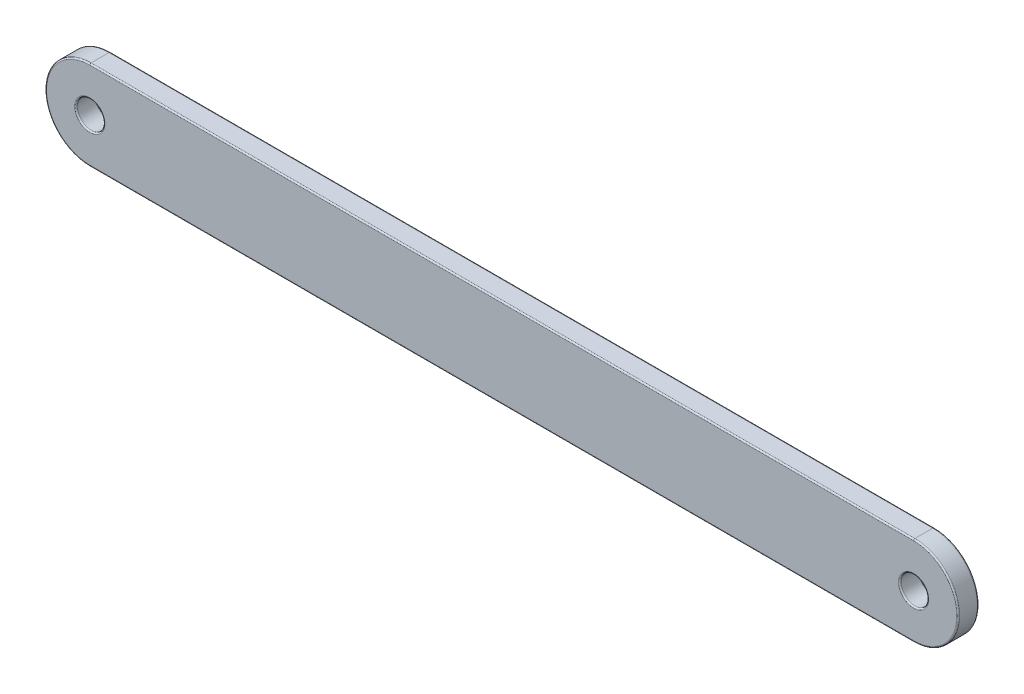
ISO-10303-21;
HEADER;
FILE_DESCRIPTION(('STEP AP214'),'2;1');
FILE_NAME('part.step','',(''),(''),'','','');
FILE_SCHEMA(('AUTOMOTIVE_DESIGN { 1 0 10303 214 1 1 1 1 }'));
ENDSEC;
DATA;
#1=APPLICATION_CONTEXT('core data for automotive mechanical design processes');
#2=APPLICATION_PROTOCOL_DEFINITION('international standard','automotive_design',2000,#1);
#3=PRODUCT_CONTEXT('',#1,'mechanical');
#4=PRODUCT('Part','Part','',(#3));
#5=PRODUCT_RELATED_PRODUCT_CATEGORY('part','',(#4));
#6=PRODUCT_DEFINITION_FORMATION('','',#4);
#7=PRODUCT_DEFINITION_CONTEXT('part definition',#1,'design');
#8=PRODUCT_DEFINITION('design','',#6,#7);
#9=PRODUCT_DEFINITION_SHAPE('','',#8);
#10=(LENGTH_UNIT() NAMED_UNIT(*) SI_UNIT(.MILLI.,.METRE.));
#11=(NAMED_UNIT(*) PLANE_ANGLE_UNIT() SI_UNIT($,.RADIAN.));
#12=(NAMED_UNIT(*) SI_UNIT($,.STERADIAN.) SOLID_ANGLE_UNIT());
#13=UNCERTAINTY_MEASURE_WITH_UNIT(LENGTH_MEASURE(1.E-05),#10,'distance_accuracy_value','');
#14=(GEOMETRIC_REPRESENTATION_CONTEXT(3) GLOBAL_UNCERTAINTY_ASSIGNED_CONTEXT((#13)) GLOBAL_UNIT_ASSIGNED_CONTEXT((#10,
#11,#12)) REPRESENTATION_CONTEXT('',''));
#15=CARTESIAN_POINT('',(0.,0.,0.));
#16=DIRECTION('',(0.,0.,1.));
#17=DIRECTION('',(1.,0.,0.));
#18=AXIS2_PLACEMENT_3D('',#15,#16,#17);
#19=CARTESIAN_POINT('',(-30.,0.,1.5));
#20=DIRECTION('',(0.,0.,1.));
#21=DIRECTION('',(1.,0.,0.));
#22=AXIS2_PLACEMENT_3D('',#19,#20,#21);
#23=PLANE('',#22);
#24=CARTESIAN_POINT('',(30.,0.,1.5));
#25=DIRECTION('',(0.,0.,1.));
#26=DIRECTION('',(1.,0.,0.));
#27=AXIS2_PLACEMENT_3D('',#24,#25,#26);
#28=CIRCLE('',#27,1.1);
#29=CARTESIAN_POINT('',(31.1,0.,1.5));
#30=VERTEX_POINT('',#29);
#31=EDGE_CURVE('E175',#30,#30,#28,.F.);
#32=ORIENTED_EDGE('',*,*,#31,.T.);
#33=EDGE_LOOP('',(#32));
#34=FACE_BOUND('',#33,.T.);
#35=CARTESIAN_POINT('',(-30.,0.,1.5));
#36=DIRECTION('',(0.,0.,1.));
#37=DIRECTION('',(1.,0.,0.));
#38=AXIS2_PLACEMENT_3D('',#35,#36,#37);
#39=CIRCLE('',#38,1.1);
#40=CARTESIAN_POINT('',(-28.9,0.,1.5));
#41=VERTEX_POINT('',#40);
#42=EDGE_CURVE('E171',#41,#41,#39,.F.);
#43=ORIENTED_EDGE('',*,*,#42,.T.);
#44=EDGE_LOOP('',(#43));
#45=FACE_BOUND('',#44,.T.);
#46=DIRECTION('',(-1.,0.,0.));
#47=VECTOR('',#46,1.);
#48=CARTESIAN_POINT('',(-30.,3.15,1.5));
#49=LINE('',#48,#47);
#50=CARTESIAN_POINT('',(30.,3.15,1.5));
#51=VERTEX_POINT('',#50);
#52=CARTESIAN_POINT('',(-30.,3.15,1.5));
#53=VERTEX_POINT('',#52);
#54=EDGE_CURVE('E158',#51,#53,#49,.T.);
#55=ORIENTED_EDGE('',*,*,#54,.T.);
#56=CARTESIAN_POINT('',(-30.,0.,1.5));
#57=DIRECTION('',(0.,0.,1.));
#58=DIRECTION('',(1.,0.,0.));
#59=AXIS2_PLACEMENT_3D('',#56,#57,#58);
#60=CIRCLE('',#59,3.15);
#61=CARTESIAN_POINT('',(-30.,-3.15,1.5));
#62=VERTEX_POINT('',#61);
#63=EDGE_CURVE('E167',#53,#62,#60,.T.);
#64=ORIENTED_EDGE('',*,*,#63,.T.);
#65=DIRECTION('',(1.,0.,0.));
#66=VECTOR('',#65,1.);
#67=CARTESIAN_POINT('',(30.,-3.15,1.5));
#68=LINE('',#67,#66);
#69=CARTESIAN_POINT('',(30.,-3.15,1.5));
#70=VERTEX_POINT('',#69);
#71=EDGE_CURVE('E164',#62,#70,#68,.T.);
#72=ORIENTED_EDGE('',*,*,#71,.T.);
#73=CARTESIAN_POINT('',(30.,0.,1.5));
#74=DIRECTION('',(0.,0.,1.));
#75=DIRECTION('',(1.,0.,0.));
#76=AXIS2_PLACEMENT_3D('',#73,#74,#75);
#77=CIRCLE('',#76,3.15);
#78=EDGE_CURVE('E161',#70,#51,#77,.T.);
#79=ORIENTED_EDGE('',*,*,#78,.T.);
#80=EDGE_LOOP('',(#55,#64,#72,#79));
#81=FACE_BOUND('',#80,.T.);
#82=ADVANCED_FACE('F39',(#34,#45,#81),#23,.T.);
#83=CARTESIAN_POINT('',(-30.,0.,0.));
#84=DIRECTION('',(0.,0.,1.));
#85=DIRECTION('',(1.,0.,0.));
#86=AXIS2_PLACEMENT_3D('',#83,#84,#85);
#87=PLANE('',#86);
#88=CARTESIAN_POINT('',(30.,0.,0.));
#89=DIRECTION('',(0.,0.,1.));
#90=DIRECTION('',(1.,0.,0.));
#91=AXIS2_PLACEMENT_3D('',#88,#89,#90);
#92=CIRCLE('',#91,1.1);
#93=CARTESIAN_POINT('',(31.1,0.,0.));
#94=VERTEX_POINT('',#93);
#95=EDGE_CURVE('E142',#94,#94,#92,.T.);
#96=ORIENTED_EDGE('',*,*,#95,.T.);
#97=EDGE_LOOP('',(#96));
#98=FACE_BOUND('',#97,.T.);
#99=CARTESIAN_POINT('',(-30.,0.,0.));
#100=DIRECTION('',(0.,0.,1.));
#101=DIRECTION('',(1.,0.,0.));
#102=AXIS2_PLACEMENT_3D('',#99,#100,#101);
#103=CIRCLE('',#102,1.1);
#104=CARTESIAN_POINT('',(-28.9,0.,0.));
#105=VERTEX_POINT('',#104);
#106=EDGE_CURVE('E137',#105,#105,#103,.T.);
#107=ORIENTED_EDGE('',*,*,#106,.T.);
#108=EDGE_LOOP('',(#107));
#109=FACE_BOUND('',#108,.T.);
#110=DIRECTION('',(1.,0.,0.));
#111=VECTOR('',#110,1.);
#112=CARTESIAN_POINT('',(-30.,-3.15,0.));
#113=LINE('',#112,#111);
#114=CARTESIAN_POINT('',(30.,-3.15,0.));
#115=VERTEX_POINT('',#114);
#116=CARTESIAN_POINT('',(-30.,-3.15,0.));
#117=VERTEX_POINT('',#116);
#118=EDGE_CURVE('E135',#115,#117,#113,.F.);
#119=ORIENTED_EDGE('',*,*,#118,.T.);
#120=CARTESIAN_POINT('',(-30.,0.,0.));
#121=DIRECTION('',(0.,0.,1.));
#122=DIRECTION('',(1.,0.,0.));
#123=AXIS2_PLACEMENT_3D('',#120,#121,#122);
#124=CIRCLE('',#123,3.15);
#125=CARTESIAN_POINT('',(-30.,3.15,0.));
#126=VERTEX_POINT('',#125);
#127=EDGE_CURVE('E112',#117,#126,#124,.F.);
#128=ORIENTED_EDGE('',*,*,#127,.T.);
#129=DIRECTION('',(-1.,0.,0.));
#130=VECTOR('',#129,1.);
#131=CARTESIAN_POINT('',(-30.,3.15,0.));
#132=LINE('',#131,#130);
#133=CARTESIAN_POINT('',(30.,3.15,0.));
#134=VERTEX_POINT('',#133);
#135=EDGE_CURVE('E123',#126,#134,#132,.F.);
#136=ORIENTED_EDGE('',*,*,#135,.T.);
#137=CARTESIAN_POINT('',(30.,0.,0.));
#138=DIRECTION('',(0.,0.,1.));
#139=DIRECTION('',(1.,0.,0.));
#140=AXIS2_PLACEMENT_3D('',#137,#138,#139);
#141=CIRCLE('',#140,3.15);
#142=EDGE_CURVE('E130',#134,#115,#141,.F.);
#143=ORIENTED_EDGE('',*,*,#142,.T.);
#144=EDGE_LOOP('',(#119,#128,#136,#143));
#145=FACE_BOUND('',#144,.T.);
#146=ADVANCED_FACE('F133',(#98,#109,#145),#87,.F.);
#147=CARTESIAN_POINT('',(-30.,0.,1.5));
#148=DIRECTION('',(0.,0.,-1.));
#149=DIRECTION('',(-1.,0.,0.));
#150=AXIS2_PLACEMENT_3D('',#147,#148,#149);
#151=CYLINDRICAL_SURFACE('',#150,3.25);
#152=DIRECTION('',(0.,0.,-1.));
#153=VECTOR('',#152,1.);
#154=CARTESIAN_POINT('',(-30.,3.25,1.5));
#155=LINE('',#154,#153);
#156=CARTESIAN_POINT('',(-30.,3.25,1.4));
#157=VERTEX_POINT('',#156);
#158=CARTESIAN_POINT('',(-30.,3.25,0.1));
#159=VERTEX_POINT('',#158);
#160=EDGE_CURVE('E213',#157,#159,#155,.T.);
#161=ORIENTED_EDGE('',*,*,#160,.T.);
#162=CARTESIAN_POINT('',(-30.,0.,0.1));
#163=DIRECTION('',(0.,0.,1.));
#164=DIRECTION('',(1.,0.,0.));
#165=AXIS2_PLACEMENT_3D('',#162,#163,#164);
#166=CIRCLE('',#165,3.25);
#167=CARTESIAN_POINT('',(-30.,-3.25,0.1));
#168=VERTEX_POINT('',#167);
#169=EDGE_CURVE('E115',#159,#168,#166,.T.);
#170=ORIENTED_EDGE('',*,*,#169,.T.);
#171=DIRECTION('',(0.,0.,-1.));
#172=VECTOR('',#171,1.);
#173=CARTESIAN_POINT('',(-30.,-3.25,1.5));
#174=LINE('',#173,#172);
#175=CARTESIAN_POINT('',(-30.,-3.25,1.4));
#176=VERTEX_POINT('',#175);
#177=EDGE_CURVE('E131',#176,#168,#174,.T.);
#178=ORIENTED_EDGE('',*,*,#177,.F.);
#179=CARTESIAN_POINT('',(-30.,0.,1.4));
#180=DIRECTION('',(0.,0.,1.));
#181=DIRECTION('',(1.,0.,0.));
#182=AXIS2_PLACEMENT_3D('',#179,#180,#181);
#183=CIRCLE('',#182,3.25);
#184=EDGE_CURVE('E187',#176,#157,#183,.F.);
#185=ORIENTED_EDGE('',*,*,#184,.T.);
#186=EDGE_LOOP('',(#161,#170,#178,#185));
#187=FACE_BOUND('',#186,.T.);
#188=ADVANCED_FACE('F260',(#187),#151,.T.);
#189=CARTESIAN_POINT('',(-30.,-3.25,1.5));
#190=DIRECTION('',(0.,1.,0.));
#191=DIRECTION('',(0.,0.,1.));
#192=AXIS2_PLACEMENT_3D('',#189,#190,#191);
#193=PLANE('',#192);
#194=ORIENTED_EDGE('',*,*,#177,.T.);
#195=DIRECTION('',(1.,0.,0.));
#196=VECTOR('',#195,1.);
#197=CARTESIAN_POINT('',(-30.,-3.25,0.1));
#198=LINE('',#197,#196);
#199=CARTESIAN_POINT('',(30.,-3.25,0.1));
#200=VERTEX_POINT('',#199);
#201=EDGE_CURVE('E196',#168,#200,#198,.T.);
#202=ORIENTED_EDGE('',*,*,#201,.T.);
#203=DIRECTION('',(0.,0.,-1.));
#204=VECTOR('',#203,1.);
#205=CARTESIAN_POINT('',(30.,-3.25,1.5));
#206=LINE('',#205,#204);
#207=CARTESIAN_POINT('',(30.,-3.25,1.4));
#208=VERTEX_POINT('',#207);
#209=EDGE_CURVE('E238',#208,#200,#206,.T.);
#210=ORIENTED_EDGE('',*,*,#209,.F.);
#211=DIRECTION('',(1.,0.,0.));
#212=VECTOR('',#211,1.);
#213=CARTESIAN_POINT('',(-30.,-3.25,1.4));
#214=LINE('',#213,#212);
#215=EDGE_CURVE('E193',#208,#176,#214,.F.);
#216=ORIENTED_EDGE('',*,*,#215,.T.);
#217=EDGE_LOOP('',(#194,#202,#210,#216));
#218=FACE_BOUND('',#217,.T.);
#219=ADVANCED_FACE('F242',(#218),#193,.F.);
#220=CARTESIAN_POINT('',(30.,0.,1.5));
#221=DIRECTION('',(0.,0.,-1.));
#222=DIRECTION('',(-1.,0.,0.));
#223=AXIS2_PLACEMENT_3D('',#220,#221,#222);
#224=CYLINDRICAL_SURFACE('',#223,3.25);
#225=ORIENTED_EDGE('',*,*,#209,.T.);
#226=CARTESIAN_POINT('',(30.,0.,0.1));
#227=DIRECTION('',(0.,0.,1.));
#228=DIRECTION('',(1.,0.,0.));
#229=AXIS2_PLACEMENT_3D('',#226,#227,#228);
#230=CIRCLE('',#229,3.25);
#231=CARTESIAN_POINT('',(30.,3.25,0.1));
#232=VERTEX_POINT('',#231);
#233=EDGE_CURVE('E57',#200,#232,#230,.T.);
#234=ORIENTED_EDGE('',*,*,#233,.T.);
#235=DIRECTION('',(0.,0.,-1.));
#236=VECTOR('',#235,1.);
#237=CARTESIAN_POINT('',(30.,3.25,1.5));
#238=LINE('',#237,#236);
#239=CARTESIAN_POINT('',(30.,3.25,1.4));
#240=VERTEX_POINT('',#239);
#241=EDGE_CURVE('E239',#240,#232,#238,.T.);
#242=ORIENTED_EDGE('',*,*,#241,.F.);
#243=CARTESIAN_POINT('',(30.,0.,1.4));
#244=DIRECTION('',(0.,0.,1.));
#245=DIRECTION('',(1.,0.,0.));
#246=AXIS2_PLACEMENT_3D('',#243,#244,#245);
#247=CIRCLE('',#246,3.25);
#248=EDGE_CURVE('E199',#240,#208,#247,.F.);
#249=ORIENTED_EDGE('',*,*,#248,.T.);
#250=EDGE_LOOP('',(#225,#234,#242,#249));
#251=FACE_BOUND('',#250,.T.);
#252=ADVANCED_FACE('F237',(#251),#224,.T.);
#253=CARTESIAN_POINT('',(-30.,3.25,1.5));
#254=DIRECTION('',(0.,-1.,0.));
#255=DIRECTION('',(0.,0.,-1.));
#256=AXIS2_PLACEMENT_3D('',#253,#254,#255);
#257=PLANE('',#256);
#258=ORIENTED_EDGE('',*,*,#241,.T.);
#259=DIRECTION('',(-1.,0.,0.));
#260=VECTOR('',#259,1.);
#261=CARTESIAN_POINT('',(-30.,3.25,0.1));
#262=LINE('',#261,#260);
#263=EDGE_CURVE('E11',#232,#159,#262,.T.);
#264=ORIENTED_EDGE('',*,*,#263,.T.);
#265=ORIENTED_EDGE('',*,*,#160,.F.);
#266=DIRECTION('',(-1.,0.,0.));
#267=VECTOR('',#266,1.);
#268=CARTESIAN_POINT('',(30.,3.25,1.4));
#269=LINE('',#268,#267);
#270=EDGE_CURVE('E49',#157,#240,#269,.F.);
#271=ORIENTED_EDGE('',*,*,#270,.T.);
#272=EDGE_LOOP('',(#258,#264,#265,#271));
#273=FACE_BOUND('',#272,.T.);
#274=ADVANCED_FACE('F263',(#273),#257,.F.);
#275=CARTESIAN_POINT('',(-30.,0.,1.5));
#276=DIRECTION('',(0.,0.,-1.));
#277=DIRECTION('',(-1.,0.,0.));
#278=AXIS2_PLACEMENT_3D('',#275,#276,#277);
#279=CYLINDRICAL_SURFACE('',#278,1.);
#280=CARTESIAN_POINT('',(-30.,0.,0.1));
#281=DIRECTION('',(0.,0.,1.));
#282=DIRECTION('',(1.,0.,0.));
#283=AXIS2_PLACEMENT_3D('',#280,#281,#282);
#284=CIRCLE('',#283,1.);
#285=CARTESIAN_POINT('',(-29.,0.,0.1));
#286=VERTEX_POINT('',#285);
#287=EDGE_CURVE('E183',#286,#286,#284,.F.);
#288=ORIENTED_EDGE('',*,*,#287,.T.);
#289=EDGE_LOOP('',(#288));
#290=FACE_BOUND('',#289,.T.);
#291=CARTESIAN_POINT('',(-30.,0.,1.4));
#292=DIRECTION('',(0.,0.,1.));
#293=DIRECTION('',(1.,0.,0.));
#294=AXIS2_PLACEMENT_3D('',#291,#292,#293);
#295=CIRCLE('',#294,1.);
#296=CARTESIAN_POINT('',(-29.,0.,1.4));
#297=VERTEX_POINT('',#296);
#298=EDGE_CURVE('E179',#297,#297,#295,.T.);
#299=ORIENTED_EDGE('',*,*,#298,.T.);
#300=EDGE_LOOP('',(#299));
#301=FACE_BOUND('',#300,.T.);
#302=ADVANCED_FACE('F265',(#290,#301),#279,.F.);
#303=CARTESIAN_POINT('',(30.,0.,1.5));
#304=DIRECTION('',(0.,0.,-1.));
#305=DIRECTION('',(-1.,0.,0.));
#306=AXIS2_PLACEMENT_3D('',#303,#304,#305);
#307=CYLINDRICAL_SURFACE('',#306,1.);
#308=CARTESIAN_POINT('',(30.,0.,0.1));
#309=DIRECTION('',(0.,0.,1.));
#310=DIRECTION('',(1.,0.,0.));
#311=AXIS2_PLACEMENT_3D('',#308,#309,#310);
#312=CIRCLE('',#311,1.);
#313=CARTESIAN_POINT('',(31.,0.,0.1));
#314=VERTEX_POINT('',#313);
#315=EDGE_CURVE('E154',#314,#314,#312,.F.);
#316=ORIENTED_EDGE('',*,*,#315,.T.);
#317=EDGE_LOOP('',(#316));
#318=FACE_BOUND('',#317,.T.);
#319=CARTESIAN_POINT('',(30.,0.,1.4));
#320=DIRECTION('',(0.,0.,1.));
#321=DIRECTION('',(1.,0.,0.));
#322=AXIS2_PLACEMENT_3D('',#319,#320,#321);
#323=CIRCLE('',#322,1.);
#324=CARTESIAN_POINT('',(31.,0.,1.4));
#325=VERTEX_POINT('',#324);
#326=EDGE_CURVE('E150',#325,#325,#323,.T.);
#327=ORIENTED_EDGE('',*,*,#326,.T.);
#328=EDGE_LOOP('',(#327));
#329=FACE_BOUND('',#328,.T.);
#330=ADVANCED_FACE('F271',(#318,#329),#307,.F.);
#331=CARTESIAN_POINT('',(30.,0.,0.1));
#332=DIRECTION('',(0.,0.,1.));
#333=DIRECTION('',(1.,0.,0.));
#334=AXIS2_PLACEMENT_3D('',#331,#332,#333);
#335=TOROIDAL_SURFACE('',#334,1.1,0.1);
#336=ORIENTED_EDGE('',*,*,#315,.F.);
#337=EDGE_LOOP('',(#336));
#338=FACE_BOUND('',#337,.T.);
#339=ORIENTED_EDGE('',*,*,#95,.F.);
#340=EDGE_LOOP('',(#339));
#341=FACE_BOUND('',#340,.T.);
#342=ADVANCED_FACE('F286',(#338,#341),#335,.T.);
#343=CARTESIAN_POINT('',(30.,0.,1.4));
#344=DIRECTION('',(0.,0.,1.));
#345=DIRECTION('',(1.,0.,0.));
#346=AXIS2_PLACEMENT_3D('',#343,#344,#345);
#347=TOROIDAL_SURFACE('',#346,1.1,0.1);
#348=ORIENTED_EDGE('',*,*,#31,.F.);
#349=EDGE_LOOP('',(#348));
#350=FACE_BOUND('',#349,.T.);
#351=ORIENTED_EDGE('',*,*,#326,.F.);
#352=EDGE_LOOP('',(#351));
#353=FACE_BOUND('',#352,.T.);
#354=ADVANCED_FACE('F291',(#350,#353),#347,.T.);
#355=CARTESIAN_POINT('',(-30.,0.,0.1));
#356=DIRECTION('',(0.,0.,1.));
#357=DIRECTION('',(1.,0.,0.));
#358=AXIS2_PLACEMENT_3D('',#355,#356,#357);
#359=TOROIDAL_SURFACE('',#358,1.1,0.1);
#360=ORIENTED_EDGE('',*,*,#287,.F.);
#361=EDGE_LOOP('',(#360));
#362=FACE_BOUND('',#361,.T.);
#363=ORIENTED_EDGE('',*,*,#106,.F.);
#364=EDGE_LOOP('',(#363));
#365=FACE_BOUND('',#364,.T.);
#366=ADVANCED_FACE('F299',(#362,#365),#359,.T.);
#367=CARTESIAN_POINT('',(-30.,0.,1.4));
#368=DIRECTION('',(0.,0.,1.));
#369=DIRECTION('',(1.,0.,0.));
#370=AXIS2_PLACEMENT_3D('',#367,#368,#369);
#371=TOROIDAL_SURFACE('',#370,1.1,0.1);
#372=ORIENTED_EDGE('',*,*,#42,.F.);
#373=EDGE_LOOP('',(#372));
#374=FACE_BOUND('',#373,.T.);
#375=ORIENTED_EDGE('',*,*,#298,.F.);
#376=EDGE_LOOP('',(#375));
#377=FACE_BOUND('',#376,.T.);
#378=ADVANCED_FACE('F305',(#374,#377),#371,.T.);
#379=CARTESIAN_POINT('',(30.,0.,0.1));
#380=DIRECTION('',(0.,0.,1.));
#381=DIRECTION('',(1.,0.,0.));
#382=AXIS2_PLACEMENT_3D('',#379,#380,#381);
#383=TOROIDAL_SURFACE('',#382,3.15,0.1);
#384=CARTESIAN_POINT('',(30.,-3.15,0.1));
#385=DIRECTION('',(-1.,0.,0.));
#386=DIRECTION('',(0.,0.,1.));
#387=AXIS2_PLACEMENT_3D('',#384,#385,#386);
#388=CIRCLE('',#387,0.1);
#389=EDGE_CURVE('E119',#115,#200,#388,.T.);
#390=ORIENTED_EDGE('',*,*,#389,.F.);
#391=ORIENTED_EDGE('',*,*,#142,.F.);
#392=CARTESIAN_POINT('',(30.,3.15,0.1));
#393=DIRECTION('',(-1.,0.,0.));
#394=DIRECTION('',(0.,0.,1.));
#395=AXIS2_PLACEMENT_3D('',#392,#393,#394);
#396=CIRCLE('',#395,0.1);
#397=EDGE_CURVE('E126',#232,#134,#396,.T.);
#398=ORIENTED_EDGE('',*,*,#397,.F.);
#399=ORIENTED_EDGE('',*,*,#233,.F.);
#400=EDGE_LOOP('',(#390,#391,#398,#399));
#401=FACE_BOUND('',#400,.T.);
#402=ADVANCED_FACE('F255',(#401),#383,.T.);
#403=CARTESIAN_POINT('',(-30.,3.15,0.1));
#404=DIRECTION('',(-1.,0.,0.));
#405=DIRECTION('',(0.,0.,1.));
#406=AXIS2_PLACEMENT_3D('',#403,#404,#405);
#407=CYLINDRICAL_SURFACE('',#406,0.1);
#408=ORIENTED_EDGE('',*,*,#397,.T.);
#409=ORIENTED_EDGE('',*,*,#135,.F.);
#410=CARTESIAN_POINT('',(-30.,3.15,0.1));
#411=DIRECTION('',(-1.,0.,0.));
#412=DIRECTION('',(0.,0.,1.));
#413=AXIS2_PLACEMENT_3D('',#410,#411,#412);
#414=CIRCLE('',#413,0.1);
#415=EDGE_CURVE('E108',#159,#126,#414,.T.);
#416=ORIENTED_EDGE('',*,*,#415,.F.);
#417=ORIENTED_EDGE('',*,*,#263,.F.);
#418=EDGE_LOOP('',(#408,#409,#416,#417));
#419=FACE_BOUND('',#418,.T.);
#420=ADVANCED_FACE('F124',(#419),#407,.T.);
#421=CARTESIAN_POINT('',(-30.,-3.15,0.1));
#422=DIRECTION('',(1.,0.,0.));
#423=DIRECTION('',(0.,0.,-1.));
#424=AXIS2_PLACEMENT_3D('',#421,#422,#423);
#425=CYLINDRICAL_SURFACE('',#424,0.1);
#426=ORIENTED_EDGE('',*,*,#389,.T.);
#427=ORIENTED_EDGE('',*,*,#201,.F.);
#428=CARTESIAN_POINT('',(-30.,-3.15,0.1));
#429=DIRECTION('',(-1.,0.,0.));
#430=DIRECTION('',(0.,0.,1.));
#431=AXIS2_PLACEMENT_3D('',#428,#429,#430);
#432=CIRCLE('',#431,0.1);
#433=EDGE_CURVE('E120',#117,#168,#432,.T.);
#434=ORIENTED_EDGE('',*,*,#433,.F.);
#435=ORIENTED_EDGE('',*,*,#118,.F.);
#436=EDGE_LOOP('',(#426,#427,#434,#435));
#437=FACE_BOUND('',#436,.T.);
#438=ADVANCED_FACE('F257',(#437),#425,.T.);
#439=CARTESIAN_POINT('',(-30.,0.,0.1));
#440=DIRECTION('',(0.,0.,1.));
#441=DIRECTION('',(1.,0.,0.));
#442=AXIS2_PLACEMENT_3D('',#439,#440,#441);
#443=TOROIDAL_SURFACE('',#442,3.15,0.1);
#444=ORIENTED_EDGE('',*,*,#415,.T.);
#445=ORIENTED_EDGE('',*,*,#127,.F.);
#446=ORIENTED_EDGE('',*,*,#433,.T.);
#447=ORIENTED_EDGE('',*,*,#169,.F.);
#448=EDGE_LOOP('',(#444,#445,#446,#447));
#449=FACE_BOUND('',#448,.T.);
#450=ADVANCED_FACE('F110',(#449),#443,.T.);
#451=CARTESIAN_POINT('',(30.,0.,1.4));
#452=DIRECTION('',(0.,0.,1.));
#453=DIRECTION('',(1.,0.,0.));
#454=AXIS2_PLACEMENT_3D('',#451,#452,#453);
#455=TOROIDAL_SURFACE('',#454,3.15,0.1);
#456=CARTESIAN_POINT('',(30.,-3.15,1.4));
#457=DIRECTION('',(-1.,0.,0.));
#458=DIRECTION('',(0.,0.,1.));
#459=AXIS2_PLACEMENT_3D('',#456,#457,#458);
#460=CIRCLE('',#459,0.1);
#461=EDGE_CURVE('E219',#208,#70,#460,.T.);
#462=ORIENTED_EDGE('',*,*,#461,.F.);
#463=ORIENTED_EDGE('',*,*,#248,.F.);
#464=CARTESIAN_POINT('',(30.,3.15,1.4));
#465=DIRECTION('',(-1.,0.,0.));
#466=DIRECTION('',(0.,0.,1.));
#467=AXIS2_PLACEMENT_3D('',#464,#465,#466);
#468=CIRCLE('',#467,0.1);
#469=EDGE_CURVE('E43',#51,#240,#468,.T.);
#470=ORIENTED_EDGE('',*,*,#469,.F.);
#471=ORIENTED_EDGE('',*,*,#78,.F.);
#472=EDGE_LOOP('',(#462,#463,#470,#471));
#473=FACE_BOUND('',#472,.T.);
#474=ADVANCED_FACE('F41',(#473),#455,.T.);
#475=CARTESIAN_POINT('',(-30.,3.15,1.4));
#476=DIRECTION('',(1.,0.,0.));
#477=DIRECTION('',(0.,0.,-1.));
#478=AXIS2_PLACEMENT_3D('',#475,#476,#477);
#479=CYLINDRICAL_SURFACE('',#478,0.1);
#480=ORIENTED_EDGE('',*,*,#469,.T.);
#481=ORIENTED_EDGE('',*,*,#270,.F.);
#482=CARTESIAN_POINT('',(-30.,3.15,1.4));
#483=DIRECTION('',(-1.,0.,0.));
#484=DIRECTION('',(0.,0.,1.));
#485=AXIS2_PLACEMENT_3D('',#482,#483,#484);
#486=CIRCLE('',#485,0.1);
#487=EDGE_CURVE('E217',#53,#157,#486,.T.);
#488=ORIENTED_EDGE('',*,*,#487,.F.);
#489=ORIENTED_EDGE('',*,*,#54,.F.);
#490=EDGE_LOOP('',(#480,#481,#488,#489));
#491=FACE_BOUND('',#490,.T.);
#492=ADVANCED_FACE('F231',(#491),#479,.T.);
#493=CARTESIAN_POINT('',(-30.,-3.15,1.4));
#494=DIRECTION('',(-1.,0.,0.));
#495=DIRECTION('',(0.,0.,1.));
#496=AXIS2_PLACEMENT_3D('',#493,#494,#495);
#497=CYLINDRICAL_SURFACE('',#496,0.1);
#498=ORIENTED_EDGE('',*,*,#461,.T.);
#499=ORIENTED_EDGE('',*,*,#71,.F.);
#500=CARTESIAN_POINT('',(-30.,-3.15,1.4));
#501=DIRECTION('',(-1.,0.,0.));
#502=DIRECTION('',(0.,0.,1.));
#503=AXIS2_PLACEMENT_3D('',#500,#501,#502);
#504=CIRCLE('',#503,0.1);
#505=EDGE_CURVE('E214',#176,#62,#504,.T.);
#506=ORIENTED_EDGE('',*,*,#505,.F.);
#507=ORIENTED_EDGE('',*,*,#215,.F.);
#508=EDGE_LOOP('',(#498,#499,#506,#507));
#509=FACE_BOUND('',#508,.T.);
#510=ADVANCED_FACE('F325',(#509),#497,.T.);
#511=CARTESIAN_POINT('',(-30.,0.,1.4));
#512=DIRECTION('',(0.,0.,1.));
#513=DIRECTION('',(1.,0.,0.));
#514=AXIS2_PLACEMENT_3D('',#511,#512,#513);
#515=TOROIDAL_SURFACE('',#514,3.15,0.1);
#516=ORIENTED_EDGE('',*,*,#487,.T.);
#517=ORIENTED_EDGE('',*,*,#184,.F.);
#518=ORIENTED_EDGE('',*,*,#505,.T.);
#519=ORIENTED_EDGE('',*,*,#63,.F.);
#520=EDGE_LOOP('',(#516,#517,#518,#519));
#521=FACE_BOUND('',#520,.T.);
#522=ADVANCED_FACE('F322',(#521),#515,.T.);
#523=CLOSED_SHELL('',(#82,#146,#188,#219,#252,#274,#302,#330,#342,#354,#366,#378,#402,#420,#438,
#450,#474,#492,#510,#522));
#524=MANIFOLD_SOLID_BREP('B2',#523);
#525=ADVANCED_BREP_SHAPE_REPRESENTATION('',(#18,#524),#14);
#526=SHAPE_DEFINITION_REPRESENTATION(#9,#525);
ENDSEC;
END-ISO-10303-21;
